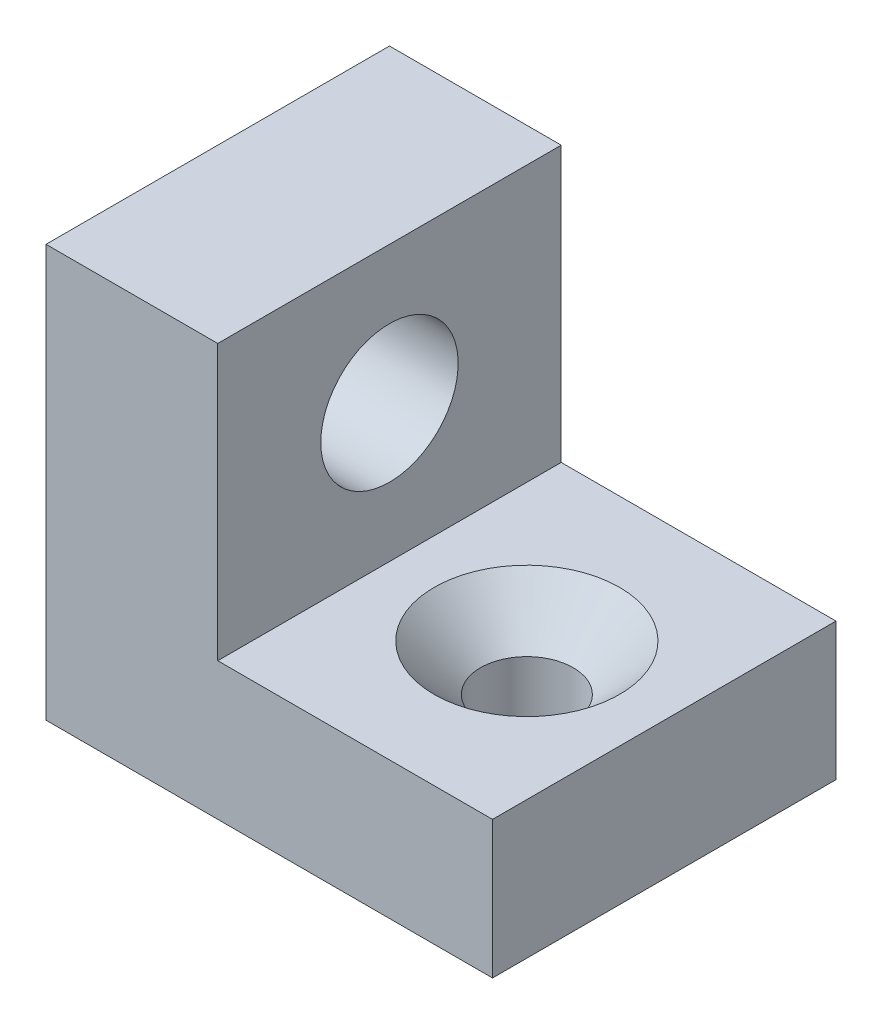
ISO-10303-21;
HEADER;
FILE_DESCRIPTION(('STEP AP214'),'2;1');
FILE_NAME('part.step','',(''),(''),'','','');
FILE_SCHEMA(('AUTOMOTIVE_DESIGN { 1 0 10303 214 1 1 1 1 }'));
ENDSEC;
DATA;
#1=APPLICATION_CONTEXT('core data for automotive mechanical design processes');
#2=APPLICATION_PROTOCOL_DEFINITION('international standard','automotive_design',2000,#1);
#3=PRODUCT_CONTEXT('',#1,'mechanical');
#4=PRODUCT('Part','Part','',(#3));
#5=PRODUCT_RELATED_PRODUCT_CATEGORY('part','',(#4));
#6=PRODUCT_DEFINITION_FORMATION('','',#4);
#7=PRODUCT_DEFINITION_CONTEXT('part definition',#1,'design');
#8=PRODUCT_DEFINITION('design','',#6,#7);
#9=PRODUCT_DEFINITION_SHAPE('','',#8);
#10=(LENGTH_UNIT() NAMED_UNIT(*) SI_UNIT(.MILLI.,.METRE.));
#11=(NAMED_UNIT(*) PLANE_ANGLE_UNIT() SI_UNIT($,.RADIAN.));
#12=(NAMED_UNIT(*) SI_UNIT($,.STERADIAN.) SOLID_ANGLE_UNIT());
#13=UNCERTAINTY_MEASURE_WITH_UNIT(LENGTH_MEASURE(1.E-05),#10,'distance_accuracy_value','');
#14=(GEOMETRIC_REPRESENTATION_CONTEXT(3) GLOBAL_UNCERTAINTY_ASSIGNED_CONTEXT((#13)) GLOBAL_UNIT_ASSIGNED_CONTEXT((#10,
#11,#12)) REPRESENTATION_CONTEXT('',''));
#15=CARTESIAN_POINT('',(0.,0.,0.));
#16=DIRECTION('',(0.,0.,1.));
#17=DIRECTION('',(1.,0.,0.));
#18=AXIS2_PLACEMENT_3D('',#15,#16,#17);
#19=CARTESIAN_POINT('',(0.,20.,50.));
#20=DIRECTION('',(0.,0.,-1.));
#21=DIRECTION('',(-1.,0.,0.));
#22=AXIS2_PLACEMENT_3D('',#19,#20,#21);
#23=PLANE('',#22);
#24=DIRECTION('',(1.,0.,0.));
#25=VECTOR('',#24,1.);
#26=CARTESIAN_POINT('',(0.,0.,50.));
#27=LINE('',#26,#25);
#28=CARTESIAN_POINT('',(-25.,0.,50.));
#29=VERTEX_POINT('',#28);
#30=CARTESIAN_POINT('',(40.,0.,50.));
#31=VERTEX_POINT('',#30);
#32=EDGE_CURVE('E68',#29,#31,#27,.T.);
#33=ORIENTED_EDGE('',*,*,#32,.T.);
#34=DIRECTION('',(0.,-1.,0.));
#35=VECTOR('',#34,1.);
#36=CARTESIAN_POINT('',(40.,20.,50.));
#37=LINE('',#36,#35);
#38=CARTESIAN_POINT('',(40.,20.,50.));
#39=VERTEX_POINT('',#38);
#40=EDGE_CURVE('E11',#39,#31,#37,.T.);
#41=ORIENTED_EDGE('',*,*,#40,.F.);
#42=DIRECTION('',(1.,0.,0.));
#43=VECTOR('',#42,1.);
#44=CARTESIAN_POINT('',(0.,20.,50.));
#45=LINE('',#44,#43);
#46=CARTESIAN_POINT('',(0.,20.,50.));
#47=VERTEX_POINT('',#46);
#48=EDGE_CURVE('E98',#47,#39,#45,.T.);
#49=ORIENTED_EDGE('',*,*,#48,.F.);
#50=DIRECTION('',(0.,1.,0.));
#51=VECTOR('',#50,1.);
#52=CARTESIAN_POINT('',(0.,0.,50.));
#53=LINE('',#52,#51);
#54=CARTESIAN_POINT('',(0.,60.,50.));
#55=VERTEX_POINT('',#54);
#56=EDGE_CURVE('E87',#47,#55,#53,.T.);
#57=ORIENTED_EDGE('',*,*,#56,.T.);
#58=DIRECTION('',(1.,0.,0.));
#59=VECTOR('',#58,1.);
#60=CARTESIAN_POINT('',(-25.,60.,50.));
#61=LINE('',#60,#59);
#62=CARTESIAN_POINT('',(-25.,60.,50.));
#63=VERTEX_POINT('',#62);
#64=EDGE_CURVE('E169',#63,#55,#61,.T.);
#65=ORIENTED_EDGE('',*,*,#64,.F.);
#66=DIRECTION('',(0.,1.,0.));
#67=VECTOR('',#66,1.);
#68=CARTESIAN_POINT('',(-25.,0.,50.));
#69=LINE('',#68,#67);
#70=EDGE_CURVE('E142',#29,#63,#69,.T.);
#71=ORIENTED_EDGE('',*,*,#70,.F.);
#72=EDGE_LOOP('',(#33,#41,#49,#57,#65,#71));
#73=FACE_BOUND('',#72,.T.);
#74=ADVANCED_FACE('F39',(#73),#23,.F.);
#75=CARTESIAN_POINT('',(40.,20.,0.));
#76=DIRECTION('',(-1.,0.,0.));
#77=DIRECTION('',(0.,0.,1.));
#78=AXIS2_PLACEMENT_3D('',#75,#76,#77);
#79=PLANE('',#78);
#80=DIRECTION('',(0.,0.,-1.));
#81=VECTOR('',#80,1.);
#82=CARTESIAN_POINT('',(40.,0.,0.));
#83=LINE('',#82,#81);
#84=CARTESIAN_POINT('',(40.,0.,0.));
#85=VERTEX_POINT('',#84);
#86=EDGE_CURVE('E109',#31,#85,#83,.T.);
#87=ORIENTED_EDGE('',*,*,#86,.T.);
#88=DIRECTION('',(0.,-1.,0.));
#89=VECTOR('',#88,1.);
#90=CARTESIAN_POINT('',(40.,20.,0.));
#91=LINE('',#90,#89);
#92=CARTESIAN_POINT('',(40.,20.,0.));
#93=VERTEX_POINT('',#92);
#94=EDGE_CURVE('E48',#93,#85,#91,.T.);
#95=ORIENTED_EDGE('',*,*,#94,.F.);
#96=DIRECTION('',(0.,0.,-1.));
#97=VECTOR('',#96,1.);
#98=CARTESIAN_POINT('',(40.,20.,0.));
#99=LINE('',#98,#97);
#100=EDGE_CURVE('E56',#39,#93,#99,.T.);
#101=ORIENTED_EDGE('',*,*,#100,.F.);
#102=ORIENTED_EDGE('',*,*,#40,.T.);
#103=EDGE_LOOP('',(#87,#95,#101,#102));
#104=FACE_BOUND('',#103,.T.);
#105=ADVANCED_FACE('F198',(#104),#79,.F.);
#106=CARTESIAN_POINT('',(0.,20.,0.));
#107=DIRECTION('',(0.,0.,1.));
#108=DIRECTION('',(1.,0.,0.));
#109=AXIS2_PLACEMENT_3D('',#106,#107,#108);
#110=PLANE('',#109);
#111=DIRECTION('',(-1.,0.,0.));
#112=VECTOR('',#111,1.);
#113=CARTESIAN_POINT('',(0.,0.,0.));
#114=LINE('',#113,#112);
#115=CARTESIAN_POINT('',(-25.,0.,0.));
#116=VERTEX_POINT('',#115);
#117=EDGE_CURVE('E105',#85,#116,#114,.T.);
#118=ORIENTED_EDGE('',*,*,#117,.T.);
#119=DIRECTION('',(0.,-1.,0.));
#120=VECTOR('',#119,1.);
#121=CARTESIAN_POINT('',(-25.,0.,0.));
#122=LINE('',#121,#120);
#123=CARTESIAN_POINT('',(-25.,60.,0.));
#124=VERTEX_POINT('',#123);
#125=EDGE_CURVE('E143',#124,#116,#122,.T.);
#126=ORIENTED_EDGE('',*,*,#125,.F.);
#127=DIRECTION('',(1.,0.,0.));
#128=VECTOR('',#127,1.);
#129=CARTESIAN_POINT('',(-25.,60.,0.));
#130=LINE('',#129,#128);
#131=CARTESIAN_POINT('',(0.,60.,0.));
#132=VERTEX_POINT('',#131);
#133=EDGE_CURVE('E163',#124,#132,#130,.T.);
#134=ORIENTED_EDGE('',*,*,#133,.T.);
#135=DIRECTION('',(0.,-1.,0.));
#136=VECTOR('',#135,1.);
#137=CARTESIAN_POINT('',(0.,0.,0.));
#138=LINE('',#137,#136);
#139=CARTESIAN_POINT('',(0.,20.,0.));
#140=VERTEX_POINT('',#139);
#141=EDGE_CURVE('E96',#132,#140,#138,.T.);
#142=ORIENTED_EDGE('',*,*,#141,.T.);
#143=DIRECTION('',(-1.,0.,0.));
#144=VECTOR('',#143,1.);
#145=CARTESIAN_POINT('',(0.,20.,0.));
#146=LINE('',#145,#144);
#147=EDGE_CURVE('E103',#93,#140,#146,.T.);
#148=ORIENTED_EDGE('',*,*,#147,.F.);
#149=ORIENTED_EDGE('',*,*,#94,.T.);
#150=EDGE_LOOP('',(#118,#126,#134,#142,#148,#149));
#151=FACE_BOUND('',#150,.T.);
#152=ADVANCED_FACE('F126',(#151),#110,.F.);
#153=CARTESIAN_POINT('',(0.,20.,0.));
#154=DIRECTION('',(0.,1.,0.));
#155=DIRECTION('',(0.,0.,1.));
#156=AXIS2_PLACEMENT_3D('',#153,#154,#155);
#157=PLANE('',#156);
#158=CARTESIAN_POINT('',(20.,20.,25.));
#159=DIRECTION('',(0.,1.,0.));
#160=DIRECTION('',(0.,0.,1.));
#161=AXIS2_PLACEMENT_3D('',#158,#159,#160);
#162=CIRCLE('',#161,13.5);
#163=CARTESIAN_POINT('',(20.,20.,38.5));
#164=VERTEX_POINT('',#163);
#165=EDGE_CURVE('E172',#164,#164,#162,.T.);
#166=ORIENTED_EDGE('',*,*,#165,.F.);
#167=EDGE_LOOP('',(#166));
#168=FACE_BOUND('',#167,.T.);
#169=DIRECTION('',(0.,0.,1.));
#170=VECTOR('',#169,1.);
#171=CARTESIAN_POINT('',(0.,20.,0.));
#172=LINE('',#171,#170);
#173=EDGE_CURVE('E77',#140,#47,#172,.T.);
#174=ORIENTED_EDGE('',*,*,#173,.T.);
#175=ORIENTED_EDGE('',*,*,#48,.T.);
#176=ORIENTED_EDGE('',*,*,#100,.T.);
#177=ORIENTED_EDGE('',*,*,#147,.T.);
#178=EDGE_LOOP('',(#174,#175,#176,#177));
#179=FACE_BOUND('',#178,.T.);
#180=ADVANCED_FACE('F101',(#168,#179),#157,.T.);
#181=CARTESIAN_POINT('',(0.,0.,0.));
#182=DIRECTION('',(0.,1.,0.));
#183=DIRECTION('',(0.,0.,1.));
#184=AXIS2_PLACEMENT_3D('',#181,#182,#183);
#185=PLANE('',#184);
#186=CARTESIAN_POINT('',(20.,0.,25.));
#187=DIRECTION('',(0.,1.,0.));
#188=DIRECTION('',(0.,0.,1.));
#189=AXIS2_PLACEMENT_3D('',#186,#187,#188);
#190=CIRCLE('',#189,6.75);
#191=CARTESIAN_POINT('',(20.,0.,31.75));
#192=VERTEX_POINT('',#191);
#193=EDGE_CURVE('E112',#192,#192,#190,.T.);
#194=ORIENTED_EDGE('',*,*,#193,.T.);
#195=EDGE_LOOP('',(#194));
#196=FACE_BOUND('',#195,.T.);
#197=ORIENTED_EDGE('',*,*,#32,.F.);
#198=DIRECTION('',(0.,0.,1.));
#199=VECTOR('',#198,1.);
#200=CARTESIAN_POINT('',(-25.,0.,0.));
#201=LINE('',#200,#199);
#202=EDGE_CURVE('E135',#116,#29,#201,.T.);
#203=ORIENTED_EDGE('',*,*,#202,.F.);
#204=ORIENTED_EDGE('',*,*,#117,.F.);
#205=ORIENTED_EDGE('',*,*,#86,.F.);
#206=EDGE_LOOP('',(#197,#203,#204,#205));
#207=FACE_BOUND('',#206,.T.);
#208=ADVANCED_FACE('F133',(#196,#207),#185,.F.);
#209=CARTESIAN_POINT('',(20.,20.,25.));
#210=DIRECTION('',(0.,1.,0.));
#211=DIRECTION('',(0.,0.,1.));
#212=AXIS2_PLACEMENT_3D('',#209,#210,#211);
#213=CYLINDRICAL_SURFACE('',#212,6.75);
#214=ORIENTED_EDGE('',*,*,#193,.F.);
#215=EDGE_LOOP('',(#214));
#216=FACE_BOUND('',#215,.T.);
#217=CARTESIAN_POINT('',(20.,13.25,25.));
#218=DIRECTION('',(0.,1.,0.));
#219=DIRECTION('',(0.,0.,1.));
#220=AXIS2_PLACEMENT_3D('',#217,#218,#219);
#221=CIRCLE('',#220,6.75);
#222=CARTESIAN_POINT('',(20.,13.25,31.75));
#223=VERTEX_POINT('',#222);
#224=EDGE_CURVE('E175',#223,#223,#221,.T.);
#225=ORIENTED_EDGE('',*,*,#224,.T.);
#226=EDGE_LOOP('',(#225));
#227=FACE_BOUND('',#226,.T.);
#228=ADVANCED_FACE('F185',(#216,#227),#213,.F.);
#229=CARTESIAN_POINT('',(20.,20.,25.));
#230=DIRECTION('',(0.,1.,0.));
#231=DIRECTION('',(0.,0.,1.));
#232=AXIS2_PLACEMENT_3D('',#229,#230,#231);
#233=CONICAL_SURFACE('',#232,13.5,0.785398163397448);
#234=ORIENTED_EDGE('',*,*,#224,.F.);
#235=EDGE_LOOP('',(#234));
#236=FACE_BOUND('',#235,.T.);
#237=ORIENTED_EDGE('',*,*,#165,.T.);
#238=EDGE_LOOP('',(#237));
#239=FACE_BOUND('',#238,.T.);
#240=ADVANCED_FACE('F187',(#236,#239),#233,.F.);
#241=CARTESIAN_POINT('',(0.,0.,0.));
#242=DIRECTION('',(1.,0.,0.));
#243=DIRECTION('',(0.,0.,-1.));
#244=AXIS2_PLACEMENT_3D('',#241,#242,#243);
#245=PLANE('',#244);
#246=CARTESIAN_POINT('',(0.,40.,25.));
#247=DIRECTION('',(-1.,0.,0.));
#248=DIRECTION('',(0.,0.,1.));
#249=AXIS2_PLACEMENT_3D('',#246,#247,#248);
#250=CIRCLE('',#249,10.);
#251=CARTESIAN_POINT('',(0.,40.,35.));
#252=VERTEX_POINT('',#251);
#253=EDGE_CURVE('E156',#252,#252,#250,.T.);
#254=ORIENTED_EDGE('',*,*,#253,.T.);
#255=EDGE_LOOP('',(#254));
#256=FACE_BOUND('',#255,.T.);
#257=ORIENTED_EDGE('',*,*,#173,.F.);
#258=ORIENTED_EDGE('',*,*,#141,.F.);
#259=DIRECTION('',(0.,0.,-1.));
#260=VECTOR('',#259,1.);
#261=CARTESIAN_POINT('',(0.,60.,0.));
#262=LINE('',#261,#260);
#263=EDGE_CURVE('E92',#55,#132,#262,.T.);
#264=ORIENTED_EDGE('',*,*,#263,.F.);
#265=ORIENTED_EDGE('',*,*,#56,.F.);
#266=EDGE_LOOP('',(#257,#258,#264,#265));
#267=FACE_BOUND('',#266,.T.);
#268=ADVANCED_FACE('F89',(#256,#267),#245,.T.);
#269=CARTESIAN_POINT('',(-25.,0.,0.));
#270=DIRECTION('',(1.,0.,0.));
#271=DIRECTION('',(0.,0.,-1.));
#272=AXIS2_PLACEMENT_3D('',#269,#270,#271);
#273=PLANE('',#272);
#274=ORIENTED_EDGE('',*,*,#125,.T.);
#275=ORIENTED_EDGE('',*,*,#202,.T.);
#276=ORIENTED_EDGE('',*,*,#70,.T.);
#277=DIRECTION('',(0.,0.,-1.));
#278=VECTOR('',#277,1.);
#279=CARTESIAN_POINT('',(-25.,60.,0.));
#280=LINE('',#279,#278);
#281=EDGE_CURVE('E148',#63,#124,#280,.T.);
#282=ORIENTED_EDGE('',*,*,#281,.T.);
#283=EDGE_LOOP('',(#274,#275,#276,#282));
#284=FACE_BOUND('',#283,.T.);
#285=CARTESIAN_POINT('',(-25.,40.,25.));
#286=DIRECTION('',(-1.,0.,0.));
#287=DIRECTION('',(0.,0.,1.));
#288=AXIS2_PLACEMENT_3D('',#285,#286,#287);
#289=CIRCLE('',#288,10.);
#290=CARTESIAN_POINT('',(-25.,40.,35.));
#291=VERTEX_POINT('',#290);
#292=EDGE_CURVE('E165',#291,#291,#289,.T.);
#293=ORIENTED_EDGE('',*,*,#292,.F.);
#294=EDGE_LOOP('',(#293));
#295=FACE_BOUND('',#294,.T.);
#296=ADVANCED_FACE('F145',(#284,#295),#273,.F.);
#297=CARTESIAN_POINT('',(-25.,60.,0.));
#298=DIRECTION('',(0.,-1.,0.));
#299=DIRECTION('',(0.,0.,-1.));
#300=AXIS2_PLACEMENT_3D('',#297,#298,#299);
#301=PLANE('',#300);
#302=ORIENTED_EDGE('',*,*,#263,.T.);
#303=ORIENTED_EDGE('',*,*,#133,.F.);
#304=ORIENTED_EDGE('',*,*,#281,.F.);
#305=ORIENTED_EDGE('',*,*,#64,.T.);
#306=EDGE_LOOP('',(#302,#303,#304,#305));
#307=FACE_BOUND('',#306,.T.);
#308=ADVANCED_FACE('F238',(#307),#301,.F.);
#309=CARTESIAN_POINT('',(-25.,40.,25.));
#310=DIRECTION('',(1.,0.,0.));
#311=DIRECTION('',(0.,0.,-1.));
#312=AXIS2_PLACEMENT_3D('',#309,#310,#311);
#313=CYLINDRICAL_SURFACE('',#312,10.);
#314=ORIENTED_EDGE('',*,*,#292,.T.);
#315=EDGE_LOOP('',(#314));
#316=FACE_BOUND('',#315,.T.);
#317=ORIENTED_EDGE('',*,*,#253,.F.);
#318=EDGE_LOOP('',(#317));
#319=FACE_BOUND('',#318,.T.);
#320=ADVANCED_FACE('F247',(#316,#319),#313,.F.);
#321=CLOSED_SHELL('',(#74,#105,#152,#180,#208,#228,#240,#268,#296,#308,#320));
#322=MANIFOLD_SOLID_BREP('B2',#321);
#323=ADVANCED_BREP_SHAPE_REPRESENTATION('',(#18,#322),#14);
#324=SHAPE_DEFINITION_REPRESENTATION(#9,#323);
ENDSEC;
END-ISO-10303-21;
